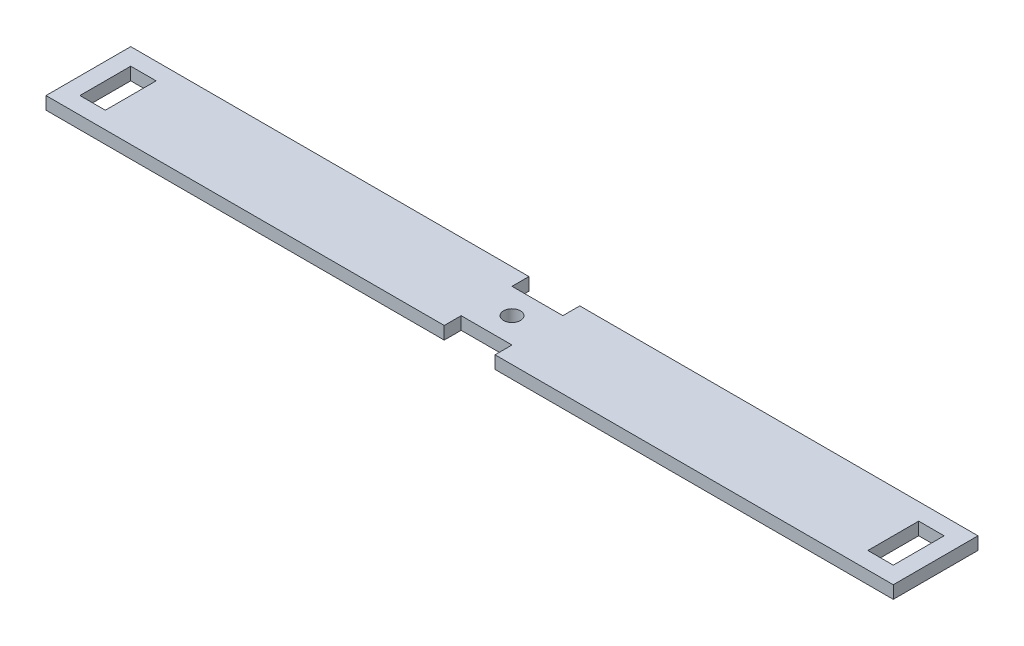
ISO-10303-21;
HEADER;
FILE_DESCRIPTION(('STEP AP214'),'2;1');
FILE_NAME('part.step','',(''),(''),'','','');
FILE_SCHEMA(('AUTOMOTIVE_DESIGN { 1 0 10303 214 1 1 1 1 }'));
ENDSEC;
DATA;
#1=APPLICATION_CONTEXT('core data for automotive mechanical design processes');
#2=APPLICATION_PROTOCOL_DEFINITION('international standard','automotive_design',2000,#1);
#3=PRODUCT_CONTEXT('',#1,'mechanical');
#4=PRODUCT('Part','Part','',(#3));
#5=PRODUCT_RELATED_PRODUCT_CATEGORY('part','',(#4));
#6=PRODUCT_DEFINITION_FORMATION('','',#4);
#7=PRODUCT_DEFINITION_CONTEXT('part definition',#1,'design');
#8=PRODUCT_DEFINITION('design','',#6,#7);
#9=PRODUCT_DEFINITION_SHAPE('','',#8);
#10=(LENGTH_UNIT() NAMED_UNIT(*) SI_UNIT(.MILLI.,.METRE.));
#11=(NAMED_UNIT(*) PLANE_ANGLE_UNIT() SI_UNIT($,.RADIAN.));
#12=(NAMED_UNIT(*) SI_UNIT($,.STERADIAN.) SOLID_ANGLE_UNIT());
#13=UNCERTAINTY_MEASURE_WITH_UNIT(LENGTH_MEASURE(1.E-05),#10,'distance_accuracy_value','');
#14=(GEOMETRIC_REPRESENTATION_CONTEXT(3) GLOBAL_UNCERTAINTY_ASSIGNED_CONTEXT((#13)) GLOBAL_UNIT_ASSIGNED_CONTEXT((#10,
#11,#12)) REPRESENTATION_CONTEXT('',''));
#15=CARTESIAN_POINT('',(0.,0.,0.));
#16=DIRECTION('',(0.,0.,1.));
#17=DIRECTION('',(1.,0.,0.));
#18=AXIS2_PLACEMENT_3D('',#15,#16,#17);
#19=CARTESIAN_POINT('',(-9.82981271411533,1.5,4.11930626589821));
#20=DIRECTION('',(0.,0.,-1.));
#21=DIRECTION('',(-1.,0.,0.));
#22=AXIS2_PLACEMENT_3D('',#19,#20,#21);
#23=PLANE('',#22);
#24=DIRECTION('',(1.,0.,0.));
#25=VECTOR('',#24,1.);
#26=CARTESIAN_POINT('',(-9.82981271411533,0.,4.11930626589821));
#27=LINE('',#26,#25);
#28=CARTESIAN_POINT('',(-9.82981271411533,0.,4.11930626589821));
#29=VERTEX_POINT('',#28);
#30=CARTESIAN_POINT('',(37.1701872858847,0.,4.11930626589821));
#31=VERTEX_POINT('',#30);
#32=EDGE_CURVE('E320',#29,#31,#27,.T.);
#33=ORIENTED_EDGE('',*,*,#32,.T.);
#34=DIRECTION('',(0.,1.,0.));
#35=VECTOR('',#34,1.);
#36=CARTESIAN_POINT('',(37.1701872858847,-0.5,4.11930626589821));
#37=LINE('',#36,#35);
#38=CARTESIAN_POINT('',(37.1701872858847,1.5,4.11930626589821));
#39=VERTEX_POINT('',#38);
#40=EDGE_CURVE('E229',#31,#39,#37,.T.);
#41=ORIENTED_EDGE('',*,*,#40,.T.);
#42=DIRECTION('',(1.,0.,0.));
#43=VECTOR('',#42,1.);
#44=CARTESIAN_POINT('',(-9.82981271411533,1.5,4.11930626589821));
#45=LINE('',#44,#43);
#46=CARTESIAN_POINT('',(-9.82981271411533,1.5,4.11930626589821));
#47=VERTEX_POINT('',#46);
#48=EDGE_CURVE('E302',#47,#39,#45,.T.);
#49=ORIENTED_EDGE('',*,*,#48,.F.);
#50=DIRECTION('',(0.,-1.,0.));
#51=VECTOR('',#50,1.);
#52=CARTESIAN_POINT('',(-9.82981271411533,1.5,4.11930626589821));
#53=LINE('',#52,#51);
#54=EDGE_CURVE('E342',#47,#29,#53,.T.);
#55=ORIENTED_EDGE('',*,*,#54,.T.);
#56=EDGE_LOOP('',(#33,#41,#49,#55));
#57=FACE_BOUND('',#56,.T.);
#58=ADVANCED_FACE('F39',(#57),#23,.F.);
#59=CARTESIAN_POINT('',(-9.82981271411533,1.5,-5.88069373410179));
#60=DIRECTION('',(0.,0.,1.));
#61=DIRECTION('',(1.,0.,0.));
#62=AXIS2_PLACEMENT_3D('',#59,#60,#61);
#63=PLANE('',#62);
#64=DIRECTION('',(-1.,0.,0.));
#65=VECTOR('',#64,1.);
#66=CARTESIAN_POINT('',(-9.82981271411533,1.5,-5.88069373410179));
#67=LINE('',#66,#65);
#68=CARTESIAN_POINT('',(37.1701872858847,1.5,-5.8806937341018));
#69=VERTEX_POINT('',#68);
#70=CARTESIAN_POINT('',(-9.82981271411533,1.5,-5.88069373410179));
#71=VERTEX_POINT('',#70);
#72=EDGE_CURVE('E309',#69,#71,#67,.T.);
#73=ORIENTED_EDGE('',*,*,#72,.F.);
#74=DIRECTION('',(0.,1.,0.));
#75=VECTOR('',#74,1.);
#76=CARTESIAN_POINT('',(37.1701872858847,-0.5,-5.8806937341018));
#77=LINE('',#76,#75);
#78=CARTESIAN_POINT('',(37.1701872858847,0.,-5.8806937341018));
#79=VERTEX_POINT('',#78);
#80=EDGE_CURVE('E255',#79,#69,#77,.T.);
#81=ORIENTED_EDGE('',*,*,#80,.F.);
#82=DIRECTION('',(-1.,0.,0.));
#83=VECTOR('',#82,1.);
#84=CARTESIAN_POINT('',(-9.82981271411533,0.,-5.88069373410179));
#85=LINE('',#84,#83);
#86=CARTESIAN_POINT('',(-9.82981271411533,0.,-5.88069373410179));
#87=VERTEX_POINT('',#86);
#88=EDGE_CURVE('E327',#79,#87,#85,.T.);
#89=ORIENTED_EDGE('',*,*,#88,.T.);
#90=DIRECTION('',(0.,-1.,0.));
#91=VECTOR('',#90,1.);
#92=CARTESIAN_POINT('',(-9.82981271411533,1.5,-5.88069373410179));
#93=LINE('',#92,#91);
#94=EDGE_CURVE('E314',#71,#87,#93,.T.);
#95=ORIENTED_EDGE('',*,*,#94,.F.);
#96=EDGE_LOOP('',(#73,#81,#89,#95));
#97=FACE_BOUND('',#96,.T.);
#98=ADVANCED_FACE('F416',(#97),#63,.F.);
#99=CARTESIAN_POINT('',(-9.82981271411533,1.5,-5.88069373410179));
#100=DIRECTION('',(1.,0.,0.));
#101=DIRECTION('',(0.,0.,-1.));
#102=AXIS2_PLACEMENT_3D('',#99,#100,#101);
#103=PLANE('',#102);
#104=DIRECTION('',(0.,0.,1.));
#105=VECTOR('',#104,1.);
#106=CARTESIAN_POINT('',(-9.82981271411533,0.,-5.88069373410179));
#107=LINE('',#106,#105);
#108=EDGE_CURVE('E315',#87,#29,#107,.T.);
#109=ORIENTED_EDGE('',*,*,#108,.T.);
#110=ORIENTED_EDGE('',*,*,#54,.F.);
#111=DIRECTION('',(0.,0.,1.));
#112=VECTOR('',#111,1.);
#113=CARTESIAN_POINT('',(-9.82981271411533,1.5,-5.88069373410179));
#114=LINE('',#113,#112);
#115=EDGE_CURVE('E296',#71,#47,#114,.T.);
#116=ORIENTED_EDGE('',*,*,#115,.F.);
#117=ORIENTED_EDGE('',*,*,#94,.T.);
#118=EDGE_LOOP('',(#109,#110,#116,#117));
#119=FACE_BOUND('',#118,.T.);
#120=ADVANCED_FACE('F41',(#119),#103,.F.);
#121=CARTESIAN_POINT('',(43.1701872858847,1.5,4.11930626589821));
#122=VERTEX_POINT('',#121);
#123=CARTESIAN_POINT('',(90.1701872858847,1.5,4.11930626589821));
#124=VERTEX_POINT('',#123);
#125=EDGE_CURVE('E300',#122,#124,#45,.T.);
#126=ORIENTED_EDGE('',*,*,#125,.F.);
#127=DIRECTION('',(0.,1.,0.));
#128=VECTOR('',#127,1.);
#129=CARTESIAN_POINT('',(43.1701872858847,-0.5,4.11930626589821));
#130=LINE('',#129,#128);
#131=CARTESIAN_POINT('',(43.1701872858847,0.,4.11930626589821));
#132=VERTEX_POINT('',#131);
#133=EDGE_CURVE('E236',#132,#122,#130,.T.);
#134=ORIENTED_EDGE('',*,*,#133,.F.);
#135=CARTESIAN_POINT('',(90.1701872858847,0.,4.11930626589821));
#136=VERTEX_POINT('',#135);
#137=EDGE_CURVE('E319',#132,#136,#27,.T.);
#138=ORIENTED_EDGE('',*,*,#137,.T.);
#139=DIRECTION('',(0.,-1.,0.));
#140=VECTOR('',#139,1.);
#141=CARTESIAN_POINT('',(90.1701872858847,1.5,4.11930626589821));
#142=LINE('',#141,#140);
#143=EDGE_CURVE('E338',#124,#136,#142,.T.);
#144=ORIENTED_EDGE('',*,*,#143,.F.);
#145=EDGE_LOOP('',(#126,#134,#138,#144));
#146=FACE_BOUND('',#145,.T.);
#147=ADVANCED_FACE('F418',(#146),#23,.F.);
#148=CARTESIAN_POINT('',(90.1701872858847,1.5,-5.88069373410179));
#149=DIRECTION('',(-1.,0.,0.));
#150=DIRECTION('',(0.,0.,1.));
#151=AXIS2_PLACEMENT_3D('',#148,#149,#150);
#152=PLANE('',#151);
#153=DIRECTION('',(0.,0.,-1.));
#154=VECTOR('',#153,1.);
#155=CARTESIAN_POINT('',(90.1701872858847,0.,-5.88069373410179));
#156=LINE('',#155,#154);
#157=CARTESIAN_POINT('',(90.1701872858847,0.,-5.88069373410179));
#158=VERTEX_POINT('',#157);
#159=EDGE_CURVE('E324',#136,#158,#156,.T.);
#160=ORIENTED_EDGE('',*,*,#159,.T.);
#161=DIRECTION('',(0.,-1.,0.));
#162=VECTOR('',#161,1.);
#163=CARTESIAN_POINT('',(90.1701872858847,1.5,-5.88069373410179));
#164=LINE('',#163,#162);
#165=CARTESIAN_POINT('',(90.1701872858847,1.5,-5.88069373410179));
#166=VERTEX_POINT('',#165);
#167=EDGE_CURVE('E334',#166,#158,#164,.T.);
#168=ORIENTED_EDGE('',*,*,#167,.F.);
#169=DIRECTION('',(0.,0.,-1.));
#170=VECTOR('',#169,1.);
#171=CARTESIAN_POINT('',(90.1701872858847,1.5,-5.88069373410179));
#172=LINE('',#171,#170);
#173=EDGE_CURVE('E306',#124,#166,#172,.T.);
#174=ORIENTED_EDGE('',*,*,#173,.F.);
#175=ORIENTED_EDGE('',*,*,#143,.T.);
#176=EDGE_LOOP('',(#160,#168,#174,#175));
#177=FACE_BOUND('',#176,.T.);
#178=ADVANCED_FACE('F427',(#177),#152,.F.);
#179=CARTESIAN_POINT('',(43.1701872858847,0.,-5.8806937341018));
#180=VERTEX_POINT('',#179);
#181=EDGE_CURVE('E301',#158,#180,#85,.T.);
#182=ORIENTED_EDGE('',*,*,#181,.T.);
#183=DIRECTION('',(0.,1.,0.));
#184=VECTOR('',#183,1.);
#185=CARTESIAN_POINT('',(43.1701872858847,-0.5,-5.8806937341018));
#186=LINE('',#185,#184);
#187=CARTESIAN_POINT('',(43.1701872858847,1.5,-5.8806937341018));
#188=VERTEX_POINT('',#187);
#189=EDGE_CURVE('E258',#180,#188,#186,.T.);
#190=ORIENTED_EDGE('',*,*,#189,.T.);
#191=EDGE_CURVE('E310',#166,#188,#67,.T.);
#192=ORIENTED_EDGE('',*,*,#191,.F.);
#193=ORIENTED_EDGE('',*,*,#167,.T.);
#194=EDGE_LOOP('',(#182,#190,#192,#193));
#195=FACE_BOUND('',#194,.T.);
#196=ADVANCED_FACE('F424',(#195),#63,.F.);
#197=CARTESIAN_POINT('',(0.,1.5,0.));
#198=DIRECTION('',(0.,1.,0.));
#199=DIRECTION('',(0.,0.,1.));
#200=AXIS2_PLACEMENT_3D('',#197,#198,#199);
#201=PLANE('',#200);
#202=DIRECTION('',(0.,0.,1.));
#203=VECTOR('',#202,1.);
#204=CARTESIAN_POINT('',(-7.82981271411533,1.5,-3.88069373410181));
#205=LINE('',#204,#203);
#206=CARTESIAN_POINT('',(-7.82981271411533,1.5,-3.88069373410181));
#207=VERTEX_POINT('',#206);
#208=CARTESIAN_POINT('',(-7.82981271411533,1.5,2.11930626589822));
#209=VERTEX_POINT('',#208);
#210=EDGE_CURVE('E55',#207,#209,#205,.T.);
#211=ORIENTED_EDGE('',*,*,#210,.F.);
#212=DIRECTION('',(-1.,0.,0.));
#213=VECTOR('',#212,1.);
#214=CARTESIAN_POINT('',(-7.82981271411533,1.5,-3.88069373410181));
#215=LINE('',#214,#213);
#216=CARTESIAN_POINT('',(-4.82981271411533,1.5,-3.88069373410181));
#217=VERTEX_POINT('',#216);
#218=EDGE_CURVE('E203',#217,#207,#215,.T.);
#219=ORIENTED_EDGE('',*,*,#218,.F.);
#220=DIRECTION('',(0.,0.,-1.));
#221=VECTOR('',#220,1.);
#222=CARTESIAN_POINT('',(-4.82981271411533,1.5,-3.88069373410181));
#223=LINE('',#222,#221);
#224=CARTESIAN_POINT('',(-4.82981271411533,1.5,2.11930626589822));
#225=VERTEX_POINT('',#224);
#226=EDGE_CURVE('E184',#225,#217,#223,.T.);
#227=ORIENTED_EDGE('',*,*,#226,.F.);
#228=DIRECTION('',(1.,0.,0.));
#229=VECTOR('',#228,1.);
#230=CARTESIAN_POINT('',(-7.82981271411533,1.5,2.11930626589822));
#231=LINE('',#230,#229);
#232=EDGE_CURVE('E195',#209,#225,#231,.T.);
#233=ORIENTED_EDGE('',*,*,#232,.F.);
#234=EDGE_LOOP('',(#211,#219,#227,#233));
#235=FACE_BOUND('',#234,.T.);
#236=DIRECTION('',(0.,0.,1.));
#237=VECTOR('',#236,1.);
#238=CARTESIAN_POINT('',(37.1701872858847,1.5,4.11930626589821));
#239=LINE('',#238,#237);
#240=CARTESIAN_POINT('',(37.1701872858847,1.5,2.11930626589822));
#241=VERTEX_POINT('',#240);
#242=EDGE_CURVE('E218',#241,#39,#239,.T.);
#243=ORIENTED_EDGE('',*,*,#242,.F.);
#244=DIRECTION('',(-1.,0.,0.));
#245=VECTOR('',#244,1.);
#246=CARTESIAN_POINT('',(37.1701872858847,1.5,2.11930626589822));
#247=LINE('',#246,#245);
#248=CARTESIAN_POINT('',(43.1701872858847,1.5,2.11930626589822));
#249=VERTEX_POINT('',#248);
#250=EDGE_CURVE('E225',#249,#241,#247,.T.);
#251=ORIENTED_EDGE('',*,*,#250,.F.);
#252=DIRECTION('',(0.,0.,-1.));
#253=VECTOR('',#252,1.);
#254=CARTESIAN_POINT('',(43.1701872858847,1.5,4.11930626589821));
#255=LINE('',#254,#253);
#256=EDGE_CURVE('E221',#122,#249,#255,.T.);
#257=ORIENTED_EDGE('',*,*,#256,.F.);
#258=ORIENTED_EDGE('',*,*,#125,.T.);
#259=ORIENTED_EDGE('',*,*,#173,.T.);
#260=ORIENTED_EDGE('',*,*,#191,.T.);
#261=DIRECTION('',(0.,0.,-1.));
#262=VECTOR('',#261,1.);
#263=CARTESIAN_POINT('',(43.1701872858847,1.5,-5.8806937341018));
#264=LINE('',#263,#262);
#265=CARTESIAN_POINT('',(43.1701872858847,1.5,-3.88069373410181));
#266=VERTEX_POINT('',#265);
#267=EDGE_CURVE('E251',#266,#188,#264,.T.);
#268=ORIENTED_EDGE('',*,*,#267,.F.);
#269=DIRECTION('',(1.,0.,0.));
#270=VECTOR('',#269,1.);
#271=CARTESIAN_POINT('',(37.1701872858847,1.5,-3.88069373410181));
#272=LINE('',#271,#270);
#273=CARTESIAN_POINT('',(37.1701872858847,1.5,-3.88069373410181));
#274=VERTEX_POINT('',#273);
#275=EDGE_CURVE('E246',#274,#266,#272,.T.);
#276=ORIENTED_EDGE('',*,*,#275,.F.);
#277=DIRECTION('',(0.,0.,1.));
#278=VECTOR('',#277,1.);
#279=CARTESIAN_POINT('',(37.1701872858847,1.5,-5.8806937341018));
#280=LINE('',#279,#278);
#281=EDGE_CURVE('E242',#69,#274,#280,.T.);
#282=ORIENTED_EDGE('',*,*,#281,.F.);
#283=ORIENTED_EDGE('',*,*,#72,.T.);
#284=ORIENTED_EDGE('',*,*,#115,.T.);
#285=ORIENTED_EDGE('',*,*,#48,.T.);
#286=EDGE_LOOP('',(#243,#251,#257,#258,#259,#260,#268,#276,#282,#283,#284,#285));
#287=FACE_BOUND('',#286,.T.);
#288=DIRECTION('',(0.,0.,-1.));
#289=VECTOR('',#288,1.);
#290=CARTESIAN_POINT('',(88.1701872858847,1.5,-3.88069373410181));
#291=LINE('',#290,#289);
#292=CARTESIAN_POINT('',(88.1701872858847,1.5,2.11930626589822));
#293=VERTEX_POINT('',#292);
#294=CARTESIAN_POINT('',(88.1701872858847,1.5,-3.88069373410181));
#295=VERTEX_POINT('',#294);
#296=EDGE_CURVE('E63',#293,#295,#291,.T.);
#297=ORIENTED_EDGE('',*,*,#296,.F.);
#298=DIRECTION('',(1.,0.,0.));
#299=VECTOR('',#298,1.);
#300=CARTESIAN_POINT('',(88.1701872858847,1.5,2.11930626589822));
#301=LINE('',#300,#299);
#302=CARTESIAN_POINT('',(85.1701872858847,1.5,2.11930626589822));
#303=VERTEX_POINT('',#302);
#304=EDGE_CURVE('E277',#303,#293,#301,.T.);
#305=ORIENTED_EDGE('',*,*,#304,.F.);
#306=DIRECTION('',(0.,0.,1.));
#307=VECTOR('',#306,1.);
#308=CARTESIAN_POINT('',(85.1701872858847,1.5,-3.88069373410181));
#309=LINE('',#308,#307);
#310=CARTESIAN_POINT('',(85.1701872858847,1.5,-3.88069373410181));
#311=VERTEX_POINT('',#310);
#312=EDGE_CURVE('E273',#311,#303,#309,.T.);
#313=ORIENTED_EDGE('',*,*,#312,.F.);
#314=DIRECTION('',(-1.,0.,0.));
#315=VECTOR('',#314,1.);
#316=CARTESIAN_POINT('',(88.1701872858847,1.5,-3.88069373410181));
#317=LINE('',#316,#315);
#318=EDGE_CURVE('E269',#295,#311,#317,.T.);
#319=ORIENTED_EDGE('',*,*,#318,.F.);
#320=EDGE_LOOP('',(#297,#305,#313,#319));
#321=FACE_BOUND('',#320,.T.);
#322=CARTESIAN_POINT('',(40.1701872858847,1.5,-0.880693734101789));
#323=DIRECTION('',(0.,1.,0.));
#324=DIRECTION('',(0.,0.,1.));
#325=AXIS2_PLACEMENT_3D('',#322,#323,#324);
#326=CIRCLE('',#325,0.999999999999998);
#327=CARTESIAN_POINT('',(40.1701872858847,1.5,0.119306265898209));
#328=VERTEX_POINT('',#327);
#329=EDGE_CURVE('E213',#328,#328,#326,.T.);
#330=ORIENTED_EDGE('',*,*,#329,.F.);
#331=EDGE_LOOP('',(#330));
#332=FACE_BOUND('',#331,.T.);
#333=ADVANCED_FACE('F200',(#235,#287,#321,#332),#201,.T.);
#334=CARTESIAN_POINT('',(0.,0.,0.));
#335=DIRECTION('',(0.,1.,0.));
#336=DIRECTION('',(0.,0.,1.));
#337=AXIS2_PLACEMENT_3D('',#334,#335,#336);
#338=PLANE('',#337);
#339=DIRECTION('',(-1.,0.,0.));
#340=VECTOR('',#339,1.);
#341=CARTESIAN_POINT('',(0.,0.,-3.88069373410181));
#342=LINE('',#341,#340);
#343=CARTESIAN_POINT('',(-4.82981271411533,0.,-3.88069373410181));
#344=VERTEX_POINT('',#343);
#345=CARTESIAN_POINT('',(-7.82981271411533,0.,-3.88069373410181));
#346=VERTEX_POINT('',#345);
#347=EDGE_CURVE('E48',#344,#346,#342,.T.);
#348=ORIENTED_EDGE('',*,*,#347,.T.);
#349=DIRECTION('',(0.,0.,1.));
#350=VECTOR('',#349,1.);
#351=CARTESIAN_POINT('',(-7.82981271411533,0.,0.));
#352=LINE('',#351,#350);
#353=CARTESIAN_POINT('',(-7.82981271411533,0.,2.11930626589822));
#354=VERTEX_POINT('',#353);
#355=EDGE_CURVE('E11',#346,#354,#352,.T.);
#356=ORIENTED_EDGE('',*,*,#355,.T.);
#357=DIRECTION('',(1.,0.,0.));
#358=VECTOR('',#357,1.);
#359=CARTESIAN_POINT('',(0.,0.,2.11930626589822));
#360=LINE('',#359,#358);
#361=CARTESIAN_POINT('',(-4.82981271411533,0.,2.11930626589822));
#362=VERTEX_POINT('',#361);
#363=EDGE_CURVE('E389',#354,#362,#360,.T.);
#364=ORIENTED_EDGE('',*,*,#363,.T.);
#365=DIRECTION('',(0.,0.,-1.));
#366=VECTOR('',#365,1.);
#367=CARTESIAN_POINT('',(-4.82981271411533,0.,0.));
#368=LINE('',#367,#366);
#369=EDGE_CURVE('E187',#362,#344,#368,.T.);
#370=ORIENTED_EDGE('',*,*,#369,.T.);
#371=EDGE_LOOP('',(#348,#356,#364,#370));
#372=FACE_BOUND('',#371,.T.);
#373=DIRECTION('',(1.,0.,0.));
#374=VECTOR('',#373,1.);
#375=CARTESIAN_POINT('',(0.,0.,2.11930626589824));
#376=LINE('',#375,#374);
#377=CARTESIAN_POINT('',(85.1701872858847,0.,2.11930626589822));
#378=VERTEX_POINT('',#377);
#379=CARTESIAN_POINT('',(88.1701872858847,0.,2.11930626589822));
#380=VERTEX_POINT('',#379);
#381=EDGE_CURVE('E369',#378,#380,#376,.T.);
#382=ORIENTED_EDGE('',*,*,#381,.T.);
#383=DIRECTION('',(0.,0.,-1.));
#384=VECTOR('',#383,1.);
#385=CARTESIAN_POINT('',(88.1701872858847,0.,0.));
#386=LINE('',#385,#384);
#387=CARTESIAN_POINT('',(88.1701872858847,0.,-3.88069373410181));
#388=VERTEX_POINT('',#387);
#389=EDGE_CURVE('E373',#380,#388,#386,.T.);
#390=ORIENTED_EDGE('',*,*,#389,.T.);
#391=DIRECTION('',(-1.,0.,0.));
#392=VECTOR('',#391,1.);
#393=CARTESIAN_POINT('',(0.,0.,-3.88069373410179));
#394=LINE('',#393,#392);
#395=CARTESIAN_POINT('',(85.1701872858847,0.,-3.88069373410181));
#396=VERTEX_POINT('',#395);
#397=EDGE_CURVE('E361',#388,#396,#394,.T.);
#398=ORIENTED_EDGE('',*,*,#397,.T.);
#399=DIRECTION('',(0.,0.,1.));
#400=VECTOR('',#399,1.);
#401=CARTESIAN_POINT('',(85.1701872858847,0.,0.));
#402=LINE('',#401,#400);
#403=EDGE_CURVE('E365',#396,#378,#402,.T.);
#404=ORIENTED_EDGE('',*,*,#403,.T.);
#405=EDGE_LOOP('',(#382,#390,#398,#404));
#406=FACE_BOUND('',#405,.T.);
#407=DIRECTION('',(-1.,0.,0.));
#408=VECTOR('',#407,1.);
#409=CARTESIAN_POINT('',(0.,0.,2.11930626589822));
#410=LINE('',#409,#408);
#411=CARTESIAN_POINT('',(43.1701872858847,0.,2.11930626589822));
#412=VERTEX_POINT('',#411);
#413=CARTESIAN_POINT('',(37.1701872858847,0.,2.11930626589822));
#414=VERTEX_POINT('',#413);
#415=EDGE_CURVE('E381',#412,#414,#410,.T.);
#416=ORIENTED_EDGE('',*,*,#415,.T.);
#417=DIRECTION('',(0.,0.,1.));
#418=VECTOR('',#417,1.);
#419=CARTESIAN_POINT('',(37.1701872858847,0.,0.));
#420=LINE('',#419,#418);
#421=EDGE_CURVE('E385',#414,#31,#420,.T.);
#422=ORIENTED_EDGE('',*,*,#421,.T.);
#423=ORIENTED_EDGE('',*,*,#32,.F.);
#424=ORIENTED_EDGE('',*,*,#108,.F.);
#425=ORIENTED_EDGE('',*,*,#88,.F.);
#426=DIRECTION('',(0.,0.,1.));
#427=VECTOR('',#426,1.);
#428=CARTESIAN_POINT('',(37.1701872858847,0.,0.));
#429=LINE('',#428,#427);
#430=CARTESIAN_POINT('',(37.1701872858847,0.,-3.88069373410181));
#431=VERTEX_POINT('',#430);
#432=EDGE_CURVE('E357',#79,#431,#429,.T.);
#433=ORIENTED_EDGE('',*,*,#432,.T.);
#434=DIRECTION('',(1.,0.,0.));
#435=VECTOR('',#434,1.);
#436=CARTESIAN_POINT('',(0.,0.,-3.88069373410182));
#437=LINE('',#436,#435);
#438=CARTESIAN_POINT('',(43.1701872858847,0.,-3.88069373410181));
#439=VERTEX_POINT('',#438);
#440=EDGE_CURVE('E346',#431,#439,#437,.T.);
#441=ORIENTED_EDGE('',*,*,#440,.T.);
#442=DIRECTION('',(0.,0.,-1.));
#443=VECTOR('',#442,1.);
#444=CARTESIAN_POINT('',(43.1701872858847,0.,0.));
#445=LINE('',#444,#443);
#446=EDGE_CURVE('E353',#439,#180,#445,.T.);
#447=ORIENTED_EDGE('',*,*,#446,.T.);
#448=ORIENTED_EDGE('',*,*,#181,.F.);
#449=ORIENTED_EDGE('',*,*,#159,.F.);
#450=ORIENTED_EDGE('',*,*,#137,.F.);
#451=DIRECTION('',(0.,0.,-1.));
#452=VECTOR('',#451,1.);
#453=CARTESIAN_POINT('',(43.1701872858847,0.,0.));
#454=LINE('',#453,#452);
#455=EDGE_CURVE('E377',#132,#412,#454,.T.);
#456=ORIENTED_EDGE('',*,*,#455,.T.);
#457=EDGE_LOOP('',(#416,#422,#423,#424,#425,#433,#441,#447,#448,#449,#450,#456));
#458=FACE_BOUND('',#457,.T.);
#459=CARTESIAN_POINT('',(40.1701872858847,0.,-0.880693734101789));
#460=DIRECTION('',(0.,1.,0.));
#461=DIRECTION('',(0.,0.,1.));
#462=AXIS2_PLACEMENT_3D('',#459,#460,#461);
#463=CIRCLE('',#462,0.999999999999998);
#464=CARTESIAN_POINT('',(40.1701872858847,0.,0.119306265898209));
#465=VERTEX_POINT('',#464);
#466=EDGE_CURVE('E295',#465,#465,#463,.T.);
#467=ORIENTED_EDGE('',*,*,#466,.T.);
#468=EDGE_LOOP('',(#467));
#469=FACE_BOUND('',#468,.T.);
#470=ADVANCED_FACE('F396',(#372,#406,#458,#469),#338,.F.);
#471=CARTESIAN_POINT('',(40.1701872858847,-0.5,-0.880693734101789));
#472=DIRECTION('',(0.,1.,0.));
#473=DIRECTION('',(0.,0.,1.));
#474=AXIS2_PLACEMENT_3D('',#471,#472,#473);
#475=CYLINDRICAL_SURFACE('',#474,0.999999999999998);
#476=ORIENTED_EDGE('',*,*,#329,.T.);
#477=EDGE_LOOP('',(#476));
#478=FACE_BOUND('',#477,.T.);
#479=ORIENTED_EDGE('',*,*,#466,.F.);
#480=EDGE_LOOP('',(#479));
#481=FACE_BOUND('',#480,.T.);
#482=ADVANCED_FACE('F492',(#478,#481),#475,.F.);
#483=CARTESIAN_POINT('',(37.1701872858847,-0.5,-5.8806937341018));
#484=DIRECTION('',(-1.,0.,0.));
#485=DIRECTION('',(0.,0.,1.));
#486=AXIS2_PLACEMENT_3D('',#483,#484,#485);
#487=PLANE('',#486);
#488=ORIENTED_EDGE('',*,*,#80,.T.);
#489=ORIENTED_EDGE('',*,*,#281,.T.);
#490=DIRECTION('',(0.,1.,0.));
#491=VECTOR('',#490,1.);
#492=CARTESIAN_POINT('',(37.1701872858847,-0.5,-3.88069373410181));
#493=LINE('',#492,#491);
#494=EDGE_CURVE('E254',#431,#274,#493,.T.);
#495=ORIENTED_EDGE('',*,*,#494,.F.);
#496=ORIENTED_EDGE('',*,*,#432,.F.);
#497=EDGE_LOOP('',(#488,#489,#495,#496));
#498=FACE_BOUND('',#497,.T.);
#499=ADVANCED_FACE('F463',(#498),#487,.F.);
#500=CARTESIAN_POINT('',(43.1701872858847,-0.5,-5.8806937341018));
#501=DIRECTION('',(1.,0.,0.));
#502=DIRECTION('',(0.,0.,-1.));
#503=AXIS2_PLACEMENT_3D('',#500,#501,#502);
#504=PLANE('',#503);
#505=DIRECTION('',(0.,1.,0.));
#506=VECTOR('',#505,1.);
#507=CARTESIAN_POINT('',(43.1701872858847,-0.5,-3.88069373410181));
#508=LINE('',#507,#506);
#509=EDGE_CURVE('E262',#439,#266,#508,.T.);
#510=ORIENTED_EDGE('',*,*,#509,.T.);
#511=ORIENTED_EDGE('',*,*,#267,.T.);
#512=ORIENTED_EDGE('',*,*,#189,.F.);
#513=ORIENTED_EDGE('',*,*,#446,.F.);
#514=EDGE_LOOP('',(#510,#511,#512,#513));
#515=FACE_BOUND('',#514,.T.);
#516=ADVANCED_FACE('F458',(#515),#504,.F.);
#517=CARTESIAN_POINT('',(37.1701872858847,-0.5,-3.88069373410181));
#518=DIRECTION('',(0.,0.,1.));
#519=DIRECTION('',(1.,0.,0.));
#520=AXIS2_PLACEMENT_3D('',#517,#518,#519);
#521=PLANE('',#520);
#522=ORIENTED_EDGE('',*,*,#494,.T.);
#523=ORIENTED_EDGE('',*,*,#275,.T.);
#524=ORIENTED_EDGE('',*,*,#509,.F.);
#525=ORIENTED_EDGE('',*,*,#440,.F.);
#526=EDGE_LOOP('',(#522,#523,#524,#525));
#527=FACE_BOUND('',#526,.T.);
#528=ADVANCED_FACE('F460',(#527),#521,.F.);
#529=CARTESIAN_POINT('',(88.1701872858847,-0.5,-3.88069373410181));
#530=DIRECTION('',(1.,0.,0.));
#531=DIRECTION('',(0.,0.,-1.));
#532=AXIS2_PLACEMENT_3D('',#529,#530,#531);
#533=PLANE('',#532);
#534=DIRECTION('',(0.,1.,0.));
#535=VECTOR('',#534,1.);
#536=CARTESIAN_POINT('',(88.1701872858847,-0.5,2.11930626589822));
#537=LINE('',#536,#535);
#538=EDGE_CURVE('E247',#380,#293,#537,.T.);
#539=ORIENTED_EDGE('',*,*,#538,.T.);
#540=ORIENTED_EDGE('',*,*,#296,.T.);
#541=DIRECTION('',(0.,1.,0.));
#542=VECTOR('',#541,1.);
#543=CARTESIAN_POINT('',(88.1701872858847,-0.5,-3.88069373410181));
#544=LINE('',#543,#542);
#545=EDGE_CURVE('E281',#388,#295,#544,.T.);
#546=ORIENTED_EDGE('',*,*,#545,.F.);
#547=ORIENTED_EDGE('',*,*,#389,.F.);
#548=EDGE_LOOP('',(#539,#540,#546,#547));
#549=FACE_BOUND('',#548,.T.);
#550=ADVANCED_FACE('F489',(#549),#533,.F.);
#551=CARTESIAN_POINT('',(88.1701872858847,-0.5,2.11930626589822));
#552=DIRECTION('',(0.,0.,1.));
#553=DIRECTION('',(1.,0.,0.));
#554=AXIS2_PLACEMENT_3D('',#551,#552,#553);
#555=PLANE('',#554);
#556=DIRECTION('',(0.,1.,0.));
#557=VECTOR('',#556,1.);
#558=CARTESIAN_POINT('',(85.1701872858847,-0.5,2.11930626589822));
#559=LINE('',#558,#557);
#560=EDGE_CURVE('E284',#378,#303,#559,.T.);
#561=ORIENTED_EDGE('',*,*,#560,.T.);
#562=ORIENTED_EDGE('',*,*,#304,.T.);
#563=ORIENTED_EDGE('',*,*,#538,.F.);
#564=ORIENTED_EDGE('',*,*,#381,.F.);
#565=EDGE_LOOP('',(#561,#562,#563,#564));
#566=FACE_BOUND('',#565,.T.);
#567=ADVANCED_FACE('F493',(#566),#555,.F.);
#568=CARTESIAN_POINT('',(85.1701872858847,-0.5,-3.88069373410181));
#569=DIRECTION('',(-1.,0.,0.));
#570=DIRECTION('',(0.,0.,1.));
#571=AXIS2_PLACEMENT_3D('',#568,#569,#570);
#572=PLANE('',#571);
#573=DIRECTION('',(0.,1.,0.));
#574=VECTOR('',#573,1.);
#575=CARTESIAN_POINT('',(85.1701872858847,-0.5,-3.88069373410181));
#576=LINE('',#575,#574);
#577=EDGE_CURVE('E287',#396,#311,#576,.T.);
#578=ORIENTED_EDGE('',*,*,#577,.T.);
#579=ORIENTED_EDGE('',*,*,#312,.T.);
#580=ORIENTED_EDGE('',*,*,#560,.F.);
#581=ORIENTED_EDGE('',*,*,#403,.F.);
#582=EDGE_LOOP('',(#578,#579,#580,#581));
#583=FACE_BOUND('',#582,.T.);
#584=ADVANCED_FACE('F496',(#583),#572,.F.);
#585=CARTESIAN_POINT('',(88.1701872858847,-0.5,-3.88069373410181));
#586=DIRECTION('',(0.,0.,-1.));
#587=DIRECTION('',(-1.,0.,0.));
#588=AXIS2_PLACEMENT_3D('',#585,#586,#587);
#589=PLANE('',#588);
#590=ORIENTED_EDGE('',*,*,#545,.T.);
#591=ORIENTED_EDGE('',*,*,#318,.T.);
#592=ORIENTED_EDGE('',*,*,#577,.F.);
#593=ORIENTED_EDGE('',*,*,#397,.F.);
#594=EDGE_LOOP('',(#590,#591,#592,#593));
#595=FACE_BOUND('',#594,.T.);
#596=ADVANCED_FACE('F482',(#595),#589,.F.);
#597=CARTESIAN_POINT('',(37.1701872858847,-0.5,4.11930626589821));
#598=DIRECTION('',(-1.,0.,0.));
#599=DIRECTION('',(0.,0.,1.));
#600=AXIS2_PLACEMENT_3D('',#597,#598,#599);
#601=PLANE('',#600);
#602=DIRECTION('',(0.,1.,0.));
#603=VECTOR('',#602,1.);
#604=CARTESIAN_POINT('',(37.1701872858847,-0.5,2.11930626589822));
#605=LINE('',#604,#603);
#606=EDGE_CURVE('E230',#414,#241,#605,.T.);
#607=ORIENTED_EDGE('',*,*,#606,.T.);
#608=ORIENTED_EDGE('',*,*,#242,.T.);
#609=ORIENTED_EDGE('',*,*,#40,.F.);
#610=ORIENTED_EDGE('',*,*,#421,.F.);
#611=EDGE_LOOP('',(#607,#608,#609,#610));
#612=FACE_BOUND('',#611,.T.);
#613=ADVANCED_FACE('F474',(#612),#601,.F.);
#614=CARTESIAN_POINT('',(37.1701872858847,-0.5,2.11930626589822));
#615=DIRECTION('',(0.,0.,-1.));
#616=DIRECTION('',(-1.,0.,0.));
#617=AXIS2_PLACEMENT_3D('',#614,#615,#616);
#618=PLANE('',#617);
#619=DIRECTION('',(0.,1.,0.));
#620=VECTOR('',#619,1.);
#621=CARTESIAN_POINT('',(43.1701872858847,-0.5,2.11930626589822));
#622=LINE('',#621,#620);
#623=EDGE_CURVE('E233',#412,#249,#622,.T.);
#624=ORIENTED_EDGE('',*,*,#623,.T.);
#625=ORIENTED_EDGE('',*,*,#250,.T.);
#626=ORIENTED_EDGE('',*,*,#606,.F.);
#627=ORIENTED_EDGE('',*,*,#415,.F.);
#628=EDGE_LOOP('',(#624,#625,#626,#627));
#629=FACE_BOUND('',#628,.T.);
#630=ADVANCED_FACE('F410',(#629),#618,.F.);
#631=CARTESIAN_POINT('',(43.1701872858847,-0.5,4.11930626589821));
#632=DIRECTION('',(1.,0.,0.));
#633=DIRECTION('',(0.,0.,-1.));
#634=AXIS2_PLACEMENT_3D('',#631,#632,#633);
#635=PLANE('',#634);
#636=ORIENTED_EDGE('',*,*,#133,.T.);
#637=ORIENTED_EDGE('',*,*,#256,.T.);
#638=ORIENTED_EDGE('',*,*,#623,.F.);
#639=ORIENTED_EDGE('',*,*,#455,.F.);
#640=EDGE_LOOP('',(#636,#637,#638,#639));
#641=FACE_BOUND('',#640,.T.);
#642=ADVANCED_FACE('F403',(#641),#635,.F.);
#643=CARTESIAN_POINT('',(-7.82981271411533,-0.5,-3.88069373410181));
#644=DIRECTION('',(-1.,0.,0.));
#645=DIRECTION('',(0.,0.,1.));
#646=AXIS2_PLACEMENT_3D('',#643,#644,#645);
#647=PLANE('',#646);
#648=DIRECTION('',(0.,1.,0.));
#649=VECTOR('',#648,1.);
#650=CARTESIAN_POINT('',(-7.82981271411533,-0.5,-3.88069373410181));
#651=LINE('',#650,#649);
#652=EDGE_CURVE('E210',#346,#207,#651,.T.);
#653=ORIENTED_EDGE('',*,*,#652,.T.);
#654=ORIENTED_EDGE('',*,*,#210,.T.);
#655=DIRECTION('',(0.,1.,0.));
#656=VECTOR('',#655,1.);
#657=CARTESIAN_POINT('',(-7.82981271411533,-0.5,2.11930626589822));
#658=LINE('',#657,#656);
#659=EDGE_CURVE('E192',#354,#209,#658,.T.);
#660=ORIENTED_EDGE('',*,*,#659,.F.);
#661=ORIENTED_EDGE('',*,*,#355,.F.);
#662=EDGE_LOOP('',(#653,#654,#660,#661));
#663=FACE_BOUND('',#662,.T.);
#664=ADVANCED_FACE('F401',(#663),#647,.F.);
#665=CARTESIAN_POINT('',(-7.82981271411533,-0.5,-3.88069373410181));
#666=DIRECTION('',(0.,0.,-1.));
#667=DIRECTION('',(-1.,0.,0.));
#668=AXIS2_PLACEMENT_3D('',#665,#666,#667);
#669=PLANE('',#668);
#670=DIRECTION('',(0.,1.,0.));
#671=VECTOR('',#670,1.);
#672=CARTESIAN_POINT('',(-4.82981271411533,-0.5,-3.88069373410181));
#673=LINE('',#672,#671);
#674=EDGE_CURVE('E191',#344,#217,#673,.T.);
#675=ORIENTED_EDGE('',*,*,#674,.T.);
#676=ORIENTED_EDGE('',*,*,#218,.T.);
#677=ORIENTED_EDGE('',*,*,#652,.F.);
#678=ORIENTED_EDGE('',*,*,#347,.F.);
#679=EDGE_LOOP('',(#675,#676,#677,#678));
#680=FACE_BOUND('',#679,.T.);
#681=ADVANCED_FACE('F400',(#680),#669,.F.);
#682=CARTESIAN_POINT('',(-4.82981271411533,-0.5,-3.88069373410181));
#683=DIRECTION('',(1.,0.,0.));
#684=DIRECTION('',(0.,0.,-1.));
#685=AXIS2_PLACEMENT_3D('',#682,#683,#684);
#686=PLANE('',#685);
#687=DIRECTION('',(0.,1.,0.));
#688=VECTOR('',#687,1.);
#689=CARTESIAN_POINT('',(-4.82981271411533,-0.5,2.11930626589822));
#690=LINE('',#689,#688);
#691=EDGE_CURVE('E179',#362,#225,#690,.T.);
#692=ORIENTED_EDGE('',*,*,#691,.T.);
#693=ORIENTED_EDGE('',*,*,#226,.T.);
#694=ORIENTED_EDGE('',*,*,#674,.F.);
#695=ORIENTED_EDGE('',*,*,#369,.F.);
#696=EDGE_LOOP('',(#692,#693,#694,#695));
#697=FACE_BOUND('',#696,.T.);
#698=ADVANCED_FACE('F181',(#697),#686,.F.);
#699=CARTESIAN_POINT('',(-7.82981271411533,-0.5,2.11930626589822));
#700=DIRECTION('',(0.,0.,1.));
#701=DIRECTION('',(1.,0.,0.));
#702=AXIS2_PLACEMENT_3D('',#699,#700,#701);
#703=PLANE('',#702);
#704=ORIENTED_EDGE('',*,*,#659,.T.);
#705=ORIENTED_EDGE('',*,*,#232,.T.);
#706=ORIENTED_EDGE('',*,*,#691,.F.);
#707=ORIENTED_EDGE('',*,*,#363,.F.);
#708=EDGE_LOOP('',(#704,#705,#706,#707));
#709=FACE_BOUND('',#708,.T.);
#710=ADVANCED_FACE('F196',(#709),#703,.F.);
#711=CLOSED_SHELL('',(#58,#98,#120,#147,#178,#196,#333,#470,#482,#499,#516,#528,#550,#567,#584,
#596,#613,#630,#642,#664,#681,#698,#710));
#712=MANIFOLD_SOLID_BREP('B2',#711);
#713=ADVANCED_BREP_SHAPE_REPRESENTATION('',(#18,#712),#14);
#714=SHAPE_DEFINITION_REPRESENTATION(#9,#713);
ENDSEC;
END-ISO-10303-21;
